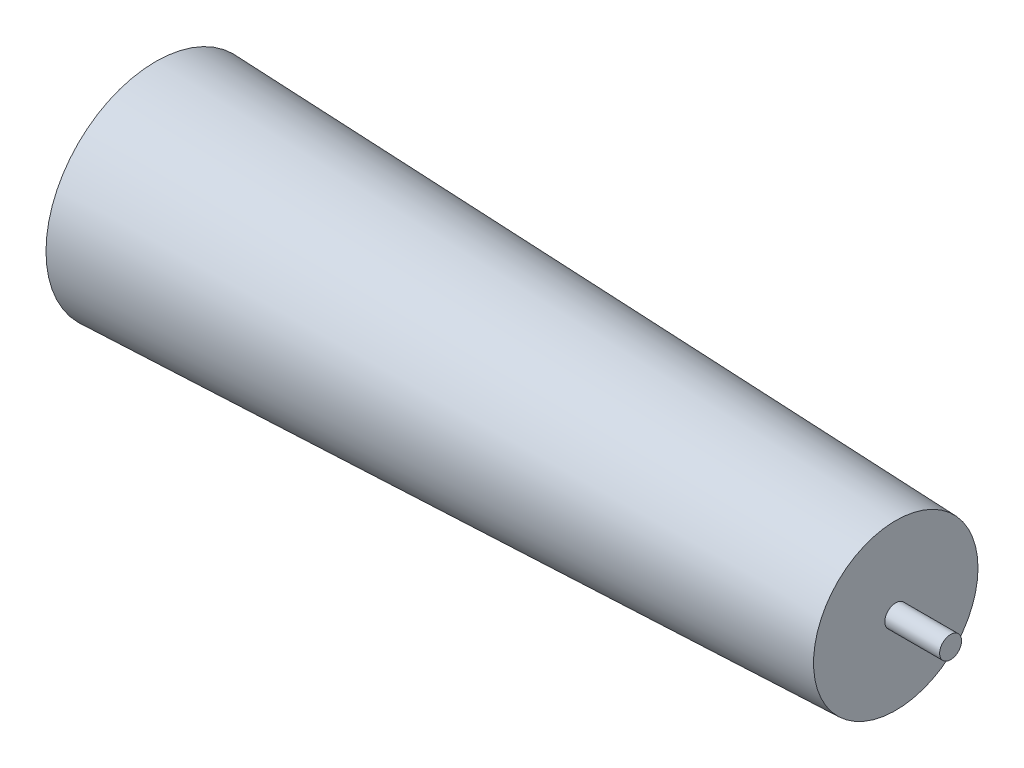
ISO-10303-21;
HEADER;
FILE_DESCRIPTION(('STEP AP214'),'2;1');
FILE_NAME('part.step','',(''),(''),'','','');
FILE_SCHEMA(('AUTOMOTIVE_DESIGN { 1 0 10303 214 1 1 1 1 }'));
ENDSEC;
DATA;
#1=APPLICATION_CONTEXT('core data for automotive mechanical design processes');
#2=APPLICATION_PROTOCOL_DEFINITION('international standard','automotive_design',2000,#1);
#3=PRODUCT_CONTEXT('',#1,'mechanical');
#4=PRODUCT('Part','Part','',(#3));
#5=PRODUCT_RELATED_PRODUCT_CATEGORY('part','',(#4));
#6=PRODUCT_DEFINITION_FORMATION('','',#4);
#7=PRODUCT_DEFINITION_CONTEXT('part definition',#1,'design');
#8=PRODUCT_DEFINITION('design','',#6,#7);
#9=PRODUCT_DEFINITION_SHAPE('','',#8);
#10=(LENGTH_UNIT() NAMED_UNIT(*) SI_UNIT(.MILLI.,.METRE.));
#11=(NAMED_UNIT(*) PLANE_ANGLE_UNIT() SI_UNIT($,.RADIAN.));
#12=(NAMED_UNIT(*) SI_UNIT($,.STERADIAN.) SOLID_ANGLE_UNIT());
#13=UNCERTAINTY_MEASURE_WITH_UNIT(LENGTH_MEASURE(1.E-05),#10,'distance_accuracy_value','');
#14=(GEOMETRIC_REPRESENTATION_CONTEXT(3) GLOBAL_UNCERTAINTY_ASSIGNED_CONTEXT((#13)) GLOBAL_UNIT_ASSIGNED_CONTEXT((#10,
#11,#12)) REPRESENTATION_CONTEXT('',''));
#15=CARTESIAN_POINT('',(0.,0.,0.));
#16=DIRECTION('',(0.,0.,1.));
#17=DIRECTION('',(1.,0.,0.));
#18=AXIS2_PLACEMENT_3D('',#15,#16,#17);
#19=CARTESIAN_POINT('',(270.,0.,0.));
#20=DIRECTION('',(1.,0.,0.));
#21=DIRECTION('',(0.,0.,-1.));
#22=AXIS2_PLACEMENT_3D('',#19,#20,#21);
#23=PLANE('',#22);
#24=CARTESIAN_POINT('',(270.,0.,0.));
#25=DIRECTION('',(1.,0.,0.));
#26=DIRECTION('',(0.,0.,-1.));
#27=AXIS2_PLACEMENT_3D('',#24,#25,#26);
#28=CIRCLE('',#27,4.);
#29=CARTESIAN_POINT('',(270.,0.,-4.));
#30=VERTEX_POINT('',#29);
#31=EDGE_CURVE('E11',#30,#30,#28,.T.);
#32=ORIENTED_EDGE('',*,*,#31,.F.);
#33=EDGE_LOOP('',(#32));
#34=FACE_BOUND('',#33,.T.);
#35=CARTESIAN_POINT('',(270.,0.,0.));
#36=DIRECTION('',(1.,0.,0.));
#37=DIRECTION('',(0.,0.,-1.));
#38=AXIS2_PLACEMENT_3D('',#35,#36,#37);
#39=CIRCLE('',#38,30.);
#40=CARTESIAN_POINT('',(270.,0.,-30.));
#41=VERTEX_POINT('',#40);
#42=EDGE_CURVE('E48',#41,#41,#39,.T.);
#43=ORIENTED_EDGE('',*,*,#42,.T.);
#44=EDGE_LOOP('',(#43));
#45=FACE_BOUND('',#44,.T.);
#46=ADVANCED_FACE('F35',(#34,#45),#23,.T.);
#47=CARTESIAN_POINT('',(0.,0.,0.));
#48=DIRECTION('',(1.,0.,0.));
#49=DIRECTION('',(0.,0.,-1.));
#50=AXIS2_PLACEMENT_3D('',#47,#48,#49);
#51=PLANE('',#50);
#52=CARTESIAN_POINT('',(0.,0.,0.));
#53=DIRECTION('',(1.,0.,0.));
#54=DIRECTION('',(0.,0.,-1.));
#55=AXIS2_PLACEMENT_3D('',#52,#53,#54);
#56=CIRCLE('',#55,4.);
#57=CARTESIAN_POINT('',(0.,0.,-4.));
#58=VERTEX_POINT('',#57);
#59=EDGE_CURVE('E39',#58,#58,#56,.T.);
#60=ORIENTED_EDGE('',*,*,#59,.T.);
#61=EDGE_LOOP('',(#60));
#62=FACE_BOUND('',#61,.T.);
#63=CARTESIAN_POINT('',(0.,0.,0.));
#64=DIRECTION('',(1.,0.,0.));
#65=DIRECTION('',(0.,0.,-1.));
#66=AXIS2_PLACEMENT_3D('',#63,#64,#65);
#67=CIRCLE('',#66,40.);
#68=CARTESIAN_POINT('',(0.,0.,-40.));
#69=VERTEX_POINT('',#68);
#70=EDGE_CURVE('E43',#69,#69,#67,.T.);
#71=ORIENTED_EDGE('',*,*,#70,.F.);
#72=EDGE_LOOP('',(#71));
#73=FACE_BOUND('',#72,.T.);
#74=ADVANCED_FACE('F72',(#62,#73),#51,.F.);
#75=CARTESIAN_POINT('',(270.,0.,0.));
#76=DIRECTION('',(-1.,0.,0.));
#77=DIRECTION('',(0.,0.,1.));
#78=AXIS2_PLACEMENT_3D('',#75,#76,#77);
#79=CONICAL_SURFACE('',#78,30.,0.03702011587393);
#80=ORIENTED_EDGE('',*,*,#70,.T.);
#81=EDGE_LOOP('',(#80));
#82=FACE_BOUND('',#81,.T.);
#83=ORIENTED_EDGE('',*,*,#42,.F.);
#84=EDGE_LOOP('',(#83));
#85=FACE_BOUND('',#84,.T.);
#86=ADVANCED_FACE('F62',(#82,#85),#79,.T.);
#87=CARTESIAN_POINT('',(-10.,0.,0.));
#88=DIRECTION('',(1.,0.,0.));
#89=DIRECTION('',(0.,0.,-1.));
#90=AXIS2_PLACEMENT_3D('',#87,#88,#89);
#91=PLANE('',#90);
#92=CARTESIAN_POINT('',(-10.,0.,0.));
#93=DIRECTION('',(1.,0.,0.));
#94=DIRECTION('',(0.,0.,-1.));
#95=AXIS2_PLACEMENT_3D('',#92,#93,#94);
#96=CIRCLE('',#95,4.);
#97=CARTESIAN_POINT('',(-10.,0.,-4.));
#98=VERTEX_POINT('',#97);
#99=EDGE_CURVE('E52',#98,#98,#96,.T.);
#100=ORIENTED_EDGE('',*,*,#99,.F.);
#101=EDGE_LOOP('',(#100));
#102=FACE_BOUND('',#101,.T.);
#103=ADVANCED_FACE('F71',(#102),#91,.F.);
#104=CARTESIAN_POINT('',(-10.,0.,0.));
#105=DIRECTION('',(1.,0.,0.));
#106=DIRECTION('',(0.,0.,-1.));
#107=AXIS2_PLACEMENT_3D('',#104,#105,#106);
#108=CYLINDRICAL_SURFACE('',#107,4.);
#109=ORIENTED_EDGE('',*,*,#99,.T.);
#110=EDGE_LOOP('',(#109));
#111=FACE_BOUND('',#110,.T.);
#112=ORIENTED_EDGE('',*,*,#59,.F.);
#113=EDGE_LOOP('',(#112));
#114=FACE_BOUND('',#113,.T.);
#115=ADVANCED_FACE('F122',(#111,#114),#108,.T.);
#116=ORIENTED_EDGE('',*,*,#31,.T.);
#117=EDGE_LOOP('',(#116));
#118=FACE_BOUND('',#117,.T.);
#119=CARTESIAN_POINT('',(290.,0.,0.));
#120=DIRECTION('',(1.,0.,0.));
#121=DIRECTION('',(0.,0.,-1.));
#122=AXIS2_PLACEMENT_3D('',#119,#120,#121);
#123=CIRCLE('',#122,4.);
#124=CARTESIAN_POINT('',(290.,0.,-4.));
#125=VERTEX_POINT('',#124);
#126=EDGE_CURVE('E112',#125,#125,#123,.T.);
#127=ORIENTED_EDGE('',*,*,#126,.F.);
#128=EDGE_LOOP('',(#127));
#129=FACE_BOUND('',#128,.T.);
#130=ADVANCED_FACE('F120',(#118,#129),#108,.T.);
#131=CARTESIAN_POINT('',(290.,0.,0.));
#132=DIRECTION('',(1.,0.,0.));
#133=DIRECTION('',(0.,0.,-1.));
#134=AXIS2_PLACEMENT_3D('',#131,#132,#133);
#135=PLANE('',#134);
#136=ORIENTED_EDGE('',*,*,#126,.T.);
#137=EDGE_LOOP('',(#136));
#138=FACE_BOUND('',#137,.T.);
#139=ADVANCED_FACE('F118',(#138),#135,.T.);
#140=CLOSED_SHELL('',(#46,#74,#86,#103,#115,#130,#139));
#141=MANIFOLD_SOLID_BREP('B2',#140);
#142=ADVANCED_BREP_SHAPE_REPRESENTATION('',(#18,#141),#14);
#143=SHAPE_DEFINITION_REPRESENTATION(#9,#142);
ENDSEC;
END-ISO-10303-21;
